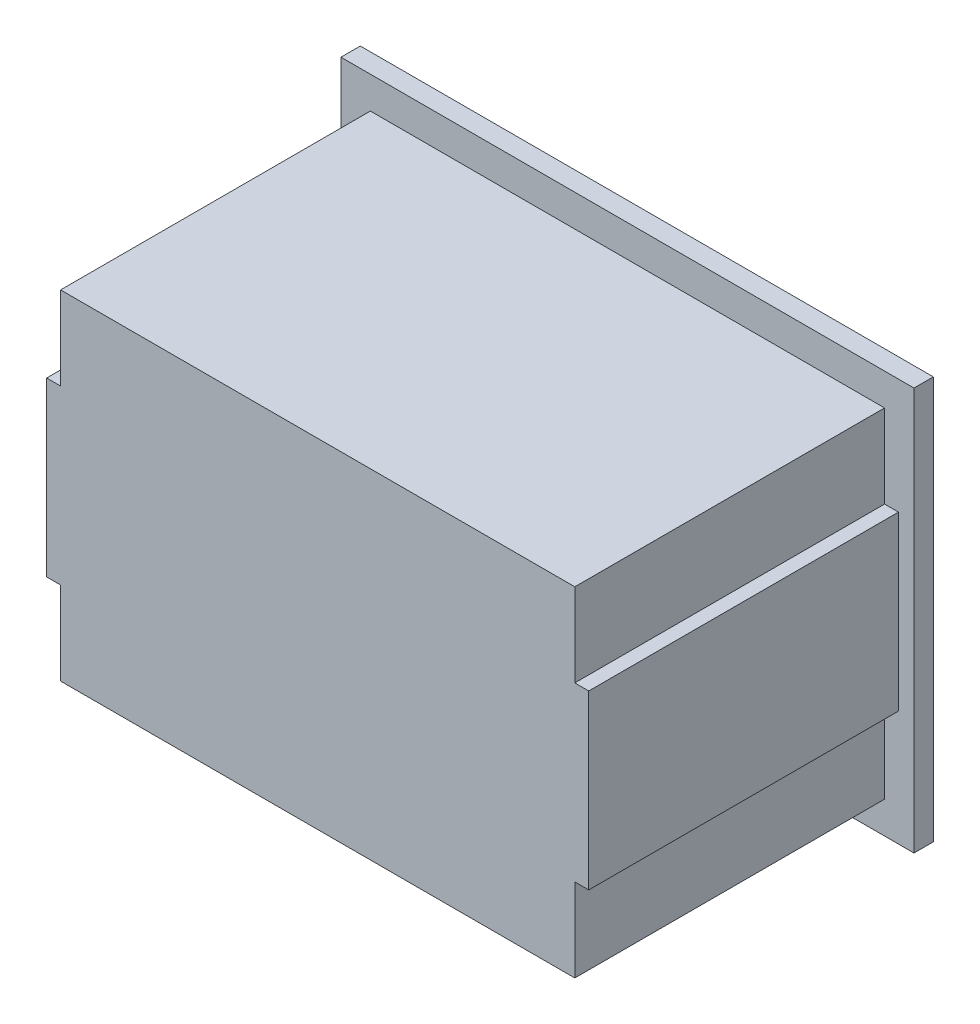
ISO-10303-21;
HEADER;
FILE_DESCRIPTION(('STEP AP214'),'2;1');
FILE_NAME('part.step','',(''),(''),'','','');
FILE_SCHEMA(('AUTOMOTIVE_DESIGN { 1 0 10303 214 1 1 1 1 }'));
ENDSEC;
DATA;
#1=APPLICATION_CONTEXT('core data for automotive mechanical design processes');
#2=APPLICATION_PROTOCOL_DEFINITION('international standard','automotive_design',2000,#1);
#3=PRODUCT_CONTEXT('',#1,'mechanical');
#4=PRODUCT('Part','Part','',(#3));
#5=PRODUCT_RELATED_PRODUCT_CATEGORY('part','',(#4));
#6=PRODUCT_DEFINITION_FORMATION('','',#4);
#7=PRODUCT_DEFINITION_CONTEXT('part definition',#1,'design');
#8=PRODUCT_DEFINITION('design','',#6,#7);
#9=PRODUCT_DEFINITION_SHAPE('','',#8);
#10=(LENGTH_UNIT() NAMED_UNIT(*) SI_UNIT(.MILLI.,.METRE.));
#11=(NAMED_UNIT(*) PLANE_ANGLE_UNIT() SI_UNIT($,.RADIAN.));
#12=(NAMED_UNIT(*) SI_UNIT($,.STERADIAN.) SOLID_ANGLE_UNIT());
#13=UNCERTAINTY_MEASURE_WITH_UNIT(LENGTH_MEASURE(1.E-05),#10,'distance_accuracy_value','');
#14=(GEOMETRIC_REPRESENTATION_CONTEXT(3) GLOBAL_UNCERTAINTY_ASSIGNED_CONTEXT((#13)) GLOBAL_UNIT_ASSIGNED_CONTEXT((#10,
#11,#12)) REPRESENTATION_CONTEXT('',''));
#15=CARTESIAN_POINT('',(0.,0.,0.));
#16=DIRECTION('',(0.,0.,1.));
#17=DIRECTION('',(1.,0.,0.));
#18=AXIS2_PLACEMENT_3D('',#15,#16,#17);
#19=CARTESIAN_POINT('',(6.64,4.375,8.));
#20=DIRECTION('',(-1.,0.,0.));
#21=DIRECTION('',(0.,-1.,0.));
#22=AXIS2_PLACEMENT_3D('',#19,#20,#21);
#23=PLANE('',#22);
#24=DIRECTION('',(0.,1.,0.));
#25=VECTOR('',#24,1.);
#26=CARTESIAN_POINT('',(6.64,4.375,0.));
#27=LINE('',#26,#25);
#28=CARTESIAN_POINT('',(6.64,-4.375,0.));
#29=VERTEX_POINT('',#28);
#30=CARTESIAN_POINT('',(6.64,-2.225,0.));
#31=VERTEX_POINT('',#30);
#32=EDGE_CURVE('E231',#29,#31,#27,.T.);
#33=ORIENTED_EDGE('',*,*,#32,.T.);
#34=DIRECTION('',(0.,0.,1.));
#35=VECTOR('',#34,1.);
#36=CARTESIAN_POINT('',(6.64,-2.225,8.));
#37=LINE('',#36,#35);
#38=CARTESIAN_POINT('',(6.64,-2.225,8.));
#39=VERTEX_POINT('',#38);
#40=EDGE_CURVE('E162',#31,#39,#37,.T.);
#41=ORIENTED_EDGE('',*,*,#40,.T.);
#42=DIRECTION('',(0.,1.,0.));
#43=VECTOR('',#42,1.);
#44=CARTESIAN_POINT('',(6.64,4.375,8.));
#45=LINE('',#44,#43);
#46=CARTESIAN_POINT('',(6.64,-4.375,8.));
#47=VERTEX_POINT('',#46);
#48=EDGE_CURVE('E218',#47,#39,#45,.T.);
#49=ORIENTED_EDGE('',*,*,#48,.F.);
#50=DIRECTION('',(0.,0.,-1.));
#51=VECTOR('',#50,1.);
#52=CARTESIAN_POINT('',(6.64,-4.375,8.));
#53=LINE('',#52,#51);
#54=EDGE_CURVE('E230',#47,#29,#53,.T.);
#55=ORIENTED_EDGE('',*,*,#54,.T.);
#56=EDGE_LOOP('',(#33,#41,#49,#55));
#57=FACE_BOUND('',#56,.T.);
#58=ADVANCED_FACE('F32',(#57),#23,.F.);
#59=CARTESIAN_POINT('',(-6.64,4.375,8.));
#60=DIRECTION('',(1.,0.,0.));
#61=DIRECTION('',(0.,1.,0.));
#62=AXIS2_PLACEMENT_3D('',#59,#60,#61);
#63=PLANE('',#62);
#64=DIRECTION('',(0.,-1.,0.));
#65=VECTOR('',#64,1.);
#66=CARTESIAN_POINT('',(-6.64,4.375,8.));
#67=LINE('',#66,#65);
#68=CARTESIAN_POINT('',(-6.64,-2.225,8.));
#69=VERTEX_POINT('',#68);
#70=CARTESIAN_POINT('',(-6.64,-4.375,8.));
#71=VERTEX_POINT('',#70);
#72=EDGE_CURVE('E224',#69,#71,#67,.T.);
#73=ORIENTED_EDGE('',*,*,#72,.F.);
#74=DIRECTION('',(0.,0.,-1.));
#75=VECTOR('',#74,1.);
#76=CARTESIAN_POINT('',(-6.64,-2.225,8.));
#77=LINE('',#76,#75);
#78=CARTESIAN_POINT('',(-6.64,-2.225,0.));
#79=VERTEX_POINT('',#78);
#80=EDGE_CURVE('E191',#69,#79,#77,.T.);
#81=ORIENTED_EDGE('',*,*,#80,.T.);
#82=DIRECTION('',(0.,-1.,0.));
#83=VECTOR('',#82,1.);
#84=CARTESIAN_POINT('',(-6.64,4.375,0.));
#85=LINE('',#84,#83);
#86=CARTESIAN_POINT('',(-6.64,-4.375,0.));
#87=VERTEX_POINT('',#86);
#88=EDGE_CURVE('E236',#79,#87,#85,.T.);
#89=ORIENTED_EDGE('',*,*,#88,.T.);
#90=DIRECTION('',(0.,0.,-1.));
#91=VECTOR('',#90,1.);
#92=CARTESIAN_POINT('',(-6.64,-4.375,8.));
#93=LINE('',#92,#91);
#94=EDGE_CURVE('E245',#71,#87,#93,.T.);
#95=ORIENTED_EDGE('',*,*,#94,.F.);
#96=EDGE_LOOP('',(#73,#81,#89,#95));
#97=FACE_BOUND('',#96,.T.);
#98=ADVANCED_FACE('F323',(#97),#63,.F.);
#99=CARTESIAN_POINT('',(6.64,2.225,8.));
#100=VERTEX_POINT('',#99);
#101=CARTESIAN_POINT('',(6.64,4.375,8.));
#102=VERTEX_POINT('',#101);
#103=EDGE_CURVE('E222',#100,#102,#45,.T.);
#104=ORIENTED_EDGE('',*,*,#103,.F.);
#105=DIRECTION('',(0.,0.,-1.));
#106=VECTOR('',#105,1.);
#107=CARTESIAN_POINT('',(6.64,2.225,8.));
#108=LINE('',#107,#106);
#109=CARTESIAN_POINT('',(6.64,2.225,0.));
#110=VERTEX_POINT('',#109);
#111=EDGE_CURVE('E188',#100,#110,#108,.T.);
#112=ORIENTED_EDGE('',*,*,#111,.T.);
#113=CARTESIAN_POINT('',(6.64,4.375,0.));
#114=VERTEX_POINT('',#113);
#115=EDGE_CURVE('E217',#110,#114,#27,.T.);
#116=ORIENTED_EDGE('',*,*,#115,.T.);
#117=DIRECTION('',(0.,0.,-1.));
#118=VECTOR('',#117,1.);
#119=CARTESIAN_POINT('',(6.64,4.375,8.));
#120=LINE('',#119,#118);
#121=EDGE_CURVE('E251',#102,#114,#120,.T.);
#122=ORIENTED_EDGE('',*,*,#121,.F.);
#123=EDGE_LOOP('',(#104,#112,#116,#122));
#124=FACE_BOUND('',#123,.T.);
#125=ADVANCED_FACE('F294',(#124),#23,.F.);
#126=CARTESIAN_POINT('',(-6.64,4.375,8.));
#127=DIRECTION('',(0.,-1.,0.));
#128=DIRECTION('',(0.,0.,-1.));
#129=AXIS2_PLACEMENT_3D('',#126,#127,#128);
#130=PLANE('',#129);
#131=DIRECTION('',(-1.,0.,0.));
#132=VECTOR('',#131,1.);
#133=CARTESIAN_POINT('',(-6.64,4.375,0.));
#134=LINE('',#133,#132);
#135=CARTESIAN_POINT('',(-6.64,4.375,0.));
#136=VERTEX_POINT('',#135);
#137=EDGE_CURVE('E233',#114,#136,#134,.T.);
#138=ORIENTED_EDGE('',*,*,#137,.T.);
#139=DIRECTION('',(0.,0.,-1.));
#140=VECTOR('',#139,1.);
#141=CARTESIAN_POINT('',(-6.64,4.375,8.));
#142=LINE('',#141,#140);
#143=CARTESIAN_POINT('',(-6.64,4.375,8.));
#144=VERTEX_POINT('',#143);
#145=EDGE_CURVE('E248',#144,#136,#142,.T.);
#146=ORIENTED_EDGE('',*,*,#145,.F.);
#147=DIRECTION('',(-1.,0.,0.));
#148=VECTOR('',#147,1.);
#149=CARTESIAN_POINT('',(-6.64,4.375,8.));
#150=LINE('',#149,#148);
#151=EDGE_CURVE('E221',#102,#144,#150,.T.);
#152=ORIENTED_EDGE('',*,*,#151,.F.);
#153=ORIENTED_EDGE('',*,*,#121,.T.);
#154=EDGE_LOOP('',(#138,#146,#152,#153));
#155=FACE_BOUND('',#154,.T.);
#156=ADVANCED_FACE('F290',(#155),#130,.F.);
#157=CARTESIAN_POINT('',(-6.64,2.225,0.));
#158=VERTEX_POINT('',#157);
#159=EDGE_CURVE('E237',#136,#158,#85,.T.);
#160=ORIENTED_EDGE('',*,*,#159,.T.);
#161=DIRECTION('',(0.,0.,1.));
#162=VECTOR('',#161,1.);
#163=CARTESIAN_POINT('',(-6.64,2.225,8.));
#164=LINE('',#163,#162);
#165=CARTESIAN_POINT('',(-6.64,2.225,8.));
#166=VERTEX_POINT('',#165);
#167=EDGE_CURVE('E185',#158,#166,#164,.T.);
#168=ORIENTED_EDGE('',*,*,#167,.T.);
#169=EDGE_CURVE('E225',#144,#166,#67,.T.);
#170=ORIENTED_EDGE('',*,*,#169,.F.);
#171=ORIENTED_EDGE('',*,*,#145,.T.);
#172=EDGE_LOOP('',(#160,#168,#170,#171));
#173=FACE_BOUND('',#172,.T.);
#174=ADVANCED_FACE('F285',(#173),#63,.F.);
#175=CARTESIAN_POINT('',(-6.64,-4.375,8.));
#176=DIRECTION('',(0.,1.,0.));
#177=DIRECTION('',(0.,0.,1.));
#178=AXIS2_PLACEMENT_3D('',#175,#176,#177);
#179=PLANE('',#178);
#180=DIRECTION('',(1.,0.,0.));
#181=VECTOR('',#180,1.);
#182=CARTESIAN_POINT('',(-6.64,-4.375,0.));
#183=LINE('',#182,#181);
#184=EDGE_CURVE('E240',#87,#29,#183,.T.);
#185=ORIENTED_EDGE('',*,*,#184,.T.);
#186=ORIENTED_EDGE('',*,*,#54,.F.);
#187=DIRECTION('',(1.,0.,0.));
#188=VECTOR('',#187,1.);
#189=CARTESIAN_POINT('',(-6.64,-4.375,8.));
#190=LINE('',#189,#188);
#191=EDGE_CURVE('E228',#71,#47,#190,.T.);
#192=ORIENTED_EDGE('',*,*,#191,.F.);
#193=ORIENTED_EDGE('',*,*,#94,.T.);
#194=EDGE_LOOP('',(#185,#186,#192,#193));
#195=FACE_BOUND('',#194,.T.);
#196=ADVANCED_FACE('F353',(#195),#179,.F.);
#197=CARTESIAN_POINT('',(0.,0.,8.));
#198=DIRECTION('',(0.,0.,1.));
#199=DIRECTION('',(1.,0.,0.));
#200=AXIS2_PLACEMENT_3D('',#197,#198,#199);
#201=PLANE('',#200);
#202=ORIENTED_EDGE('',*,*,#169,.T.);
#203=DIRECTION('',(-1.,0.,0.));
#204=VECTOR('',#203,1.);
#205=CARTESIAN_POINT('',(7.,2.225,8.));
#206=LINE('',#205,#204);
#207=CARTESIAN_POINT('',(-7.,2.225,8.));
#208=VERTEX_POINT('',#207);
#209=EDGE_CURVE('E302',#166,#208,#206,.T.);
#210=ORIENTED_EDGE('',*,*,#209,.T.);
#211=DIRECTION('',(0.,-1.,0.));
#212=VECTOR('',#211,1.);
#213=CARTESIAN_POINT('',(-7.,-2.225,8.));
#214=LINE('',#213,#212);
#215=CARTESIAN_POINT('',(-7.,-2.225,8.));
#216=VERTEX_POINT('',#215);
#217=EDGE_CURVE('E311',#208,#216,#214,.T.);
#218=ORIENTED_EDGE('',*,*,#217,.T.);
#219=DIRECTION('',(1.,0.,0.));
#220=VECTOR('',#219,1.);
#221=CARTESIAN_POINT('',(7.,-2.225,8.));
#222=LINE('',#221,#220);
#223=EDGE_CURVE('E307',#216,#69,#222,.T.);
#224=ORIENTED_EDGE('',*,*,#223,.T.);
#225=ORIENTED_EDGE('',*,*,#72,.T.);
#226=ORIENTED_EDGE('',*,*,#191,.T.);
#227=ORIENTED_EDGE('',*,*,#48,.T.);
#228=CARTESIAN_POINT('',(7.,-2.225,8.));
#229=VERTEX_POINT('',#228);
#230=EDGE_CURVE('E310',#39,#229,#222,.T.);
#231=ORIENTED_EDGE('',*,*,#230,.T.);
#232=DIRECTION('',(0.,1.,0.));
#233=VECTOR('',#232,1.);
#234=CARTESIAN_POINT('',(7.,-2.225,8.));
#235=LINE('',#234,#233);
#236=CARTESIAN_POINT('',(7.,2.225,8.));
#237=VERTEX_POINT('',#236);
#238=EDGE_CURVE('E167',#229,#237,#235,.T.);
#239=ORIENTED_EDGE('',*,*,#238,.T.);
#240=EDGE_CURVE('E299',#237,#100,#206,.T.);
#241=ORIENTED_EDGE('',*,*,#240,.T.);
#242=ORIENTED_EDGE('',*,*,#103,.T.);
#243=ORIENTED_EDGE('',*,*,#151,.T.);
#244=EDGE_LOOP('',(#202,#210,#218,#224,#225,#226,#227,#231,#239,#241,#242,#243));
#245=FACE_BOUND('',#244,.T.);
#246=ADVANCED_FACE('F301',(#245),#201,.T.);
#247=CARTESIAN_POINT('',(7.4,-5.2,-1.));
#248=DIRECTION('',(-1.,0.,0.));
#249=DIRECTION('',(0.,0.,1.));
#250=AXIS2_PLACEMENT_3D('',#247,#248,#249);
#251=PLANE('',#250);
#252=DIRECTION('',(0.,0.,1.));
#253=VECTOR('',#252,1.);
#254=CARTESIAN_POINT('',(7.4,-5.2,-1.));
#255=LINE('',#254,#253);
#256=CARTESIAN_POINT('',(7.4,-5.2,-0.499999999999998));
#257=VERTEX_POINT('',#256);
#258=CARTESIAN_POINT('',(7.4,-5.2,0.));
#259=VERTEX_POINT('',#258);
#260=EDGE_CURVE('E215',#257,#259,#255,.T.);
#261=ORIENTED_EDGE('',*,*,#260,.F.);
#262=DIRECTION('',(0.,1.,0.));
#263=VECTOR('',#262,1.);
#264=CARTESIAN_POINT('',(7.4,5.2,-0.499999999999998));
#265=LINE('',#264,#263);
#266=CARTESIAN_POINT('',(7.4,5.2,-0.499999999999998));
#267=VERTEX_POINT('',#266);
#268=EDGE_CURVE('E268',#257,#267,#265,.T.);
#269=ORIENTED_EDGE('',*,*,#268,.T.);
#270=DIRECTION('',(0.,0.,1.));
#271=VECTOR('',#270,1.);
#272=CARTESIAN_POINT('',(7.4,5.2,-1.));
#273=LINE('',#272,#271);
#274=CARTESIAN_POINT('',(7.4,5.2,0.));
#275=VERTEX_POINT('',#274);
#276=EDGE_CURVE('E209',#267,#275,#273,.T.);
#277=ORIENTED_EDGE('',*,*,#276,.T.);
#278=DIRECTION('',(0.,-1.,0.));
#279=VECTOR('',#278,1.);
#280=CARTESIAN_POINT('',(7.4,-5.2,0.));
#281=LINE('',#280,#279);
#282=EDGE_CURVE('E196',#275,#259,#281,.T.);
#283=ORIENTED_EDGE('',*,*,#282,.T.);
#284=EDGE_LOOP('',(#261,#269,#277,#283));
#285=FACE_BOUND('',#284,.T.);
#286=ADVANCED_FACE('F360',(#285),#251,.F.);
#287=CARTESIAN_POINT('',(-7.4,-5.2,-1.));
#288=DIRECTION('',(0.,1.,0.));
#289=DIRECTION('',(-1.,0.,0.));
#290=AXIS2_PLACEMENT_3D('',#287,#288,#289);
#291=PLANE('',#290);
#292=DIRECTION('',(0.,0.,1.));
#293=VECTOR('',#292,1.);
#294=CARTESIAN_POINT('',(-7.4,-5.2,-1.));
#295=LINE('',#294,#293);
#296=CARTESIAN_POINT('',(-7.4,-5.2,-0.499999999999998));
#297=VERTEX_POINT('',#296);
#298=CARTESIAN_POINT('',(-7.4,-5.2,0.));
#299=VERTEX_POINT('',#298);
#300=EDGE_CURVE('E213',#297,#299,#295,.T.);
#301=ORIENTED_EDGE('',*,*,#300,.F.);
#302=DIRECTION('',(1.,0.,0.));
#303=VECTOR('',#302,1.);
#304=CARTESIAN_POINT('',(7.4,-5.2,-0.499999999999998));
#305=LINE('',#304,#303);
#306=EDGE_CURVE('E266',#297,#257,#305,.T.);
#307=ORIENTED_EDGE('',*,*,#306,.T.);
#308=ORIENTED_EDGE('',*,*,#260,.T.);
#309=DIRECTION('',(-1.,0.,0.));
#310=VECTOR('',#309,1.);
#311=CARTESIAN_POINT('',(-7.4,-5.2,0.));
#312=LINE('',#311,#310);
#313=EDGE_CURVE('E199',#259,#299,#312,.T.);
#314=ORIENTED_EDGE('',*,*,#313,.T.);
#315=EDGE_LOOP('',(#301,#307,#308,#314));
#316=FACE_BOUND('',#315,.T.);
#317=ADVANCED_FACE('F363',(#316),#291,.F.);
#318=CARTESIAN_POINT('',(-7.4,-5.2,-1.));
#319=DIRECTION('',(1.,0.,0.));
#320=DIRECTION('',(0.,0.,-1.));
#321=AXIS2_PLACEMENT_3D('',#318,#319,#320);
#322=PLANE('',#321);
#323=DIRECTION('',(0.,0.,1.));
#324=VECTOR('',#323,1.);
#325=CARTESIAN_POINT('',(-7.4,5.2,-1.));
#326=LINE('',#325,#324);
#327=CARTESIAN_POINT('',(-7.4,5.2,-0.499999999999998));
#328=VERTEX_POINT('',#327);
#329=CARTESIAN_POINT('',(-7.4,5.2,0.));
#330=VERTEX_POINT('',#329);
#331=EDGE_CURVE('E211',#328,#330,#326,.T.);
#332=ORIENTED_EDGE('',*,*,#331,.F.);
#333=DIRECTION('',(0.,-1.,0.));
#334=VECTOR('',#333,1.);
#335=CARTESIAN_POINT('',(-7.4,-5.2,-0.499999999999998));
#336=LINE('',#335,#334);
#337=EDGE_CURVE('E263',#328,#297,#336,.T.);
#338=ORIENTED_EDGE('',*,*,#337,.T.);
#339=ORIENTED_EDGE('',*,*,#300,.T.);
#340=DIRECTION('',(0.,1.,0.));
#341=VECTOR('',#340,1.);
#342=CARTESIAN_POINT('',(-7.4,-5.2,0.));
#343=LINE('',#342,#341);
#344=EDGE_CURVE('E203',#299,#330,#343,.T.);
#345=ORIENTED_EDGE('',*,*,#344,.T.);
#346=EDGE_LOOP('',(#332,#338,#339,#345));
#347=FACE_BOUND('',#346,.T.);
#348=ADVANCED_FACE('F367',(#347),#322,.F.);
#349=CARTESIAN_POINT('',(-7.4,5.2,-1.));
#350=DIRECTION('',(0.,-1.,0.));
#351=DIRECTION('',(1.,0.,0.));
#352=AXIS2_PLACEMENT_3D('',#349,#350,#351);
#353=PLANE('',#352);
#354=ORIENTED_EDGE('',*,*,#276,.F.);
#355=DIRECTION('',(-1.,0.,0.));
#356=VECTOR('',#355,1.);
#357=CARTESIAN_POINT('',(-7.4,5.2,-0.499999999999998));
#358=LINE('',#357,#356);
#359=EDGE_CURVE('E270',#267,#328,#358,.T.);
#360=ORIENTED_EDGE('',*,*,#359,.T.);
#361=ORIENTED_EDGE('',*,*,#331,.T.);
#362=DIRECTION('',(1.,0.,0.));
#363=VECTOR('',#362,1.);
#364=CARTESIAN_POINT('',(-7.4,5.2,0.));
#365=LINE('',#364,#363);
#366=EDGE_CURVE('E206',#330,#275,#365,.T.);
#367=ORIENTED_EDGE('',*,*,#366,.T.);
#368=EDGE_LOOP('',(#354,#360,#361,#367));
#369=FACE_BOUND('',#368,.T.);
#370=ADVANCED_FACE('F371',(#369),#353,.F.);
#371=CARTESIAN_POINT('',(0.,0.,-1.));
#372=DIRECTION('',(0.,0.,-1.));
#373=DIRECTION('',(-1.,0.,0.));
#374=AXIS2_PLACEMENT_3D('',#371,#372,#373);
#375=PLANE('',#374);
#376=DIRECTION('',(-1.,0.,0.));
#377=VECTOR('',#376,1.);
#378=CARTESIAN_POINT('',(-7.4,-4.7,-1.));
#379=LINE('',#378,#377);
#380=CARTESIAN_POINT('',(6.9,-4.7,-1.));
#381=VERTEX_POINT('',#380);
#382=CARTESIAN_POINT('',(-6.9,-4.7,-1.));
#383=VERTEX_POINT('',#382);
#384=EDGE_CURVE('E258',#381,#383,#379,.T.);
#385=ORIENTED_EDGE('',*,*,#384,.T.);
#386=DIRECTION('',(0.,1.,0.));
#387=VECTOR('',#386,1.);
#388=CARTESIAN_POINT('',(-6.9,5.2,-1.));
#389=LINE('',#388,#387);
#390=CARTESIAN_POINT('',(-6.9,4.7,-1.));
#391=VERTEX_POINT('',#390);
#392=EDGE_CURVE('E260',#383,#391,#389,.T.);
#393=ORIENTED_EDGE('',*,*,#392,.T.);
#394=DIRECTION('',(1.,0.,0.));
#395=VECTOR('',#394,1.);
#396=CARTESIAN_POINT('',(7.4,4.7,-1.));
#397=LINE('',#396,#395);
#398=CARTESIAN_POINT('',(6.9,4.7,-1.));
#399=VERTEX_POINT('',#398);
#400=EDGE_CURVE('E254',#391,#399,#397,.T.);
#401=ORIENTED_EDGE('',*,*,#400,.T.);
#402=DIRECTION('',(0.,-1.,0.));
#403=VECTOR('',#402,1.);
#404=CARTESIAN_POINT('',(6.9,-5.2,-1.));
#405=LINE('',#404,#403);
#406=EDGE_CURVE('E256',#399,#381,#405,.T.);
#407=ORIENTED_EDGE('',*,*,#406,.T.);
#408=EDGE_LOOP('',(#385,#393,#401,#407));
#409=FACE_BOUND('',#408,.T.);
#410=ADVANCED_FACE('F375',(#409),#375,.T.);
#411=CARTESIAN_POINT('',(0.,0.,0.));
#412=DIRECTION('',(0.,0.,-1.));
#413=DIRECTION('',(-1.,0.,0.));
#414=AXIS2_PLACEMENT_3D('',#411,#412,#413);
#415=PLANE('',#414);
#416=DIRECTION('',(0.,1.,0.));
#417=VECTOR('',#416,1.);
#418=CARTESIAN_POINT('',(7.,-2.225,0.));
#419=LINE('',#418,#417);
#420=CARTESIAN_POINT('',(7.,-2.225,0.));
#421=VERTEX_POINT('',#420);
#422=CARTESIAN_POINT('',(7.,2.225,0.));
#423=VERTEX_POINT('',#422);
#424=EDGE_CURVE('E47',#421,#423,#419,.T.);
#425=ORIENTED_EDGE('',*,*,#424,.F.);
#426=DIRECTION('',(-1.,0.,0.));
#427=VECTOR('',#426,1.);
#428=CARTESIAN_POINT('',(0.,-2.225,0.));
#429=LINE('',#428,#427);
#430=EDGE_CURVE('E11',#421,#31,#429,.T.);
#431=ORIENTED_EDGE('',*,*,#430,.T.);
#432=ORIENTED_EDGE('',*,*,#32,.F.);
#433=ORIENTED_EDGE('',*,*,#184,.F.);
#434=ORIENTED_EDGE('',*,*,#88,.F.);
#435=DIRECTION('',(1.,0.,0.));
#436=VECTOR('',#435,1.);
#437=CARTESIAN_POINT('',(7.,-2.225,0.));
#438=LINE('',#437,#436);
#439=CARTESIAN_POINT('',(-7.,-2.225,0.));
#440=VERTEX_POINT('',#439);
#441=EDGE_CURVE('E168',#440,#79,#438,.T.);
#442=ORIENTED_EDGE('',*,*,#441,.F.);
#443=DIRECTION('',(0.,-1.,0.));
#444=VECTOR('',#443,1.);
#445=CARTESIAN_POINT('',(-7.,-2.225,0.));
#446=LINE('',#445,#444);
#447=CARTESIAN_POINT('',(-7.,2.225,0.));
#448=VERTEX_POINT('',#447);
#449=EDGE_CURVE('E181',#448,#440,#446,.T.);
#450=ORIENTED_EDGE('',*,*,#449,.F.);
#451=DIRECTION('',(1.,0.,0.));
#452=VECTOR('',#451,1.);
#453=CARTESIAN_POINT('',(0.,2.225,0.));
#454=LINE('',#453,#452);
#455=EDGE_CURVE('E40',#448,#158,#454,.T.);
#456=ORIENTED_EDGE('',*,*,#455,.T.);
#457=ORIENTED_EDGE('',*,*,#159,.F.);
#458=ORIENTED_EDGE('',*,*,#137,.F.);
#459=ORIENTED_EDGE('',*,*,#115,.F.);
#460=DIRECTION('',(-1.,0.,0.));
#461=VECTOR('',#460,1.);
#462=CARTESIAN_POINT('',(7.,2.225,0.));
#463=LINE('',#462,#461);
#464=EDGE_CURVE('E174',#423,#110,#463,.T.);
#465=ORIENTED_EDGE('',*,*,#464,.F.);
#466=EDGE_LOOP('',(#425,#431,#432,#433,#434,#442,#450,#456,#457,#458,#459,#465));
#467=FACE_BOUND('',#466,.T.);
#468=ORIENTED_EDGE('',*,*,#282,.F.);
#469=ORIENTED_EDGE('',*,*,#366,.F.);
#470=ORIENTED_EDGE('',*,*,#344,.F.);
#471=ORIENTED_EDGE('',*,*,#313,.F.);
#472=EDGE_LOOP('',(#468,#469,#470,#471));
#473=FACE_BOUND('',#472,.T.);
#474=ADVANCED_FACE('F171',(#467,#473),#415,.F.);
#475=CARTESIAN_POINT('',(6.9,0.,-1.));
#476=DIRECTION('',(0.707106781186549,0.,-0.707106781186546));
#477=DIRECTION('',(0.,1.,0.));
#478=AXIS2_PLACEMENT_3D('',#475,#476,#477);
#479=PLANE('',#478);
#480=DIRECTION('',(-0.577350269189625,-0.577350269189625,-0.577350269189627));
#481=VECTOR('',#480,1.);
#482=CARTESIAN_POINT('',(4.6,2.4,-3.3));
#483=LINE('',#482,#481);
#484=EDGE_CURVE('E275',#267,#399,#483,.T.);
#485=ORIENTED_EDGE('',*,*,#484,.F.);
#486=ORIENTED_EDGE('',*,*,#268,.F.);
#487=DIRECTION('',(-0.577350269189625,0.577350269189625,-0.577350269189627));
#488=VECTOR('',#487,1.);
#489=CARTESIAN_POINT('',(5.33333333333333,-3.13333333333334,-2.56666666666667));
#490=LINE('',#489,#488);
#491=EDGE_CURVE('E200',#381,#257,#490,.F.);
#492=ORIENTED_EDGE('',*,*,#491,.F.);
#493=ORIENTED_EDGE('',*,*,#406,.F.);
#494=EDGE_LOOP('',(#485,#486,#492,#493));
#495=FACE_BOUND('',#494,.T.);
#496=ADVANCED_FACE('F34',(#495),#479,.T.);
#497=CARTESIAN_POINT('',(0.,-4.7,-1.));
#498=DIRECTION('',(0.,-0.707106781186549,-0.707106781186546));
#499=DIRECTION('',(1.,0.,0.));
#500=AXIS2_PLACEMENT_3D('',#497,#498,#499);
#501=PLANE('',#500);
#502=ORIENTED_EDGE('',*,*,#491,.T.);
#503=ORIENTED_EDGE('',*,*,#306,.F.);
#504=DIRECTION('',(0.577350269189625,0.577350269189625,-0.577350269189627));
#505=VECTOR('',#504,1.);
#506=CARTESIAN_POINT('',(-4.60000000000001,-2.4,-3.3));
#507=LINE('',#506,#505);
#508=EDGE_CURVE('E273',#383,#297,#507,.F.);
#509=ORIENTED_EDGE('',*,*,#508,.F.);
#510=ORIENTED_EDGE('',*,*,#384,.F.);
#511=EDGE_LOOP('',(#502,#503,#509,#510));
#512=FACE_BOUND('',#511,.T.);
#513=ADVANCED_FACE('F463',(#512),#501,.T.);
#514=CARTESIAN_POINT('',(0.,4.7,-1.));
#515=DIRECTION('',(0.,0.707106781186549,-0.707106781186546));
#516=DIRECTION('',(-1.,0.,0.));
#517=AXIS2_PLACEMENT_3D('',#514,#515,#516);
#518=PLANE('',#517);
#519=ORIENTED_EDGE('',*,*,#484,.T.);
#520=ORIENTED_EDGE('',*,*,#400,.F.);
#521=DIRECTION('',(-0.577350269189625,0.577350269189625,0.577350269189627));
#522=VECTOR('',#521,1.);
#523=CARTESIAN_POINT('',(-4.6,2.4,-3.3));
#524=LINE('',#523,#522);
#525=EDGE_CURVE('E195',#328,#391,#524,.F.);
#526=ORIENTED_EDGE('',*,*,#525,.F.);
#527=ORIENTED_EDGE('',*,*,#359,.F.);
#528=EDGE_LOOP('',(#519,#520,#526,#527));
#529=FACE_BOUND('',#528,.T.);
#530=ADVANCED_FACE('F454',(#529),#518,.T.);
#531=CARTESIAN_POINT('',(-6.9,0.,-1.));
#532=DIRECTION('',(-0.707106781186549,0.,-0.707106781186546));
#533=DIRECTION('',(0.,-1.,0.));
#534=AXIS2_PLACEMENT_3D('',#531,#532,#533);
#535=PLANE('',#534);
#536=ORIENTED_EDGE('',*,*,#508,.T.);
#537=ORIENTED_EDGE('',*,*,#337,.F.);
#538=ORIENTED_EDGE('',*,*,#525,.T.);
#539=ORIENTED_EDGE('',*,*,#392,.F.);
#540=EDGE_LOOP('',(#536,#537,#538,#539));
#541=FACE_BOUND('',#540,.T.);
#542=ADVANCED_FACE('F333',(#541),#535,.T.);
#543=CARTESIAN_POINT('',(-7.,-2.225,-14.690217833647));
#544=DIRECTION('',(-1.,0.,0.));
#545=DIRECTION('',(0.,0.,1.));
#546=AXIS2_PLACEMENT_3D('',#543,#544,#545);
#547=PLANE('',#546);
#548=DIRECTION('',(0.,0.,1.));
#549=VECTOR('',#548,1.);
#550=CARTESIAN_POINT('',(-7.,2.225,-14.690217833647));
#551=LINE('',#550,#549);
#552=EDGE_CURVE('E55',#448,#208,#551,.T.);
#553=ORIENTED_EDGE('',*,*,#552,.F.);
#554=ORIENTED_EDGE('',*,*,#449,.T.);
#555=DIRECTION('',(0.,0.,1.));
#556=VECTOR('',#555,1.);
#557=CARTESIAN_POINT('',(-7.,-2.225,-14.690217833647));
#558=LINE('',#557,#556);
#559=EDGE_CURVE('E183',#440,#216,#558,.T.);
#560=ORIENTED_EDGE('',*,*,#559,.T.);
#561=ORIENTED_EDGE('',*,*,#217,.F.);
#562=EDGE_LOOP('',(#553,#554,#560,#561));
#563=FACE_BOUND('',#562,.T.);
#564=ADVANCED_FACE('F314',(#563),#547,.T.);
#565=CARTESIAN_POINT('',(7.,2.225,-14.690217833647));
#566=DIRECTION('',(0.,1.,0.));
#567=DIRECTION('',(-1.,0.,0.));
#568=AXIS2_PLACEMENT_3D('',#565,#566,#567);
#569=PLANE('',#568);
#570=ORIENTED_EDGE('',*,*,#167,.F.);
#571=ORIENTED_EDGE('',*,*,#455,.F.);
#572=ORIENTED_EDGE('',*,*,#552,.T.);
#573=ORIENTED_EDGE('',*,*,#209,.F.);
#574=EDGE_LOOP('',(#570,#571,#572,#573));
#575=FACE_BOUND('',#574,.T.);
#576=ADVANCED_FACE('F325',(#575),#569,.T.);
#577=CARTESIAN_POINT('',(7.,-2.225,-14.690217833647));
#578=DIRECTION('',(0.,-1.,0.));
#579=DIRECTION('',(1.,0.,0.));
#580=AXIS2_PLACEMENT_3D('',#577,#578,#579);
#581=PLANE('',#580);
#582=ORIENTED_EDGE('',*,*,#80,.F.);
#583=ORIENTED_EDGE('',*,*,#223,.F.);
#584=ORIENTED_EDGE('',*,*,#559,.F.);
#585=ORIENTED_EDGE('',*,*,#441,.T.);
#586=EDGE_LOOP('',(#582,#583,#584,#585));
#587=FACE_BOUND('',#586,.T.);
#588=ADVANCED_FACE('F317',(#587),#581,.T.);
#589=ORIENTED_EDGE('',*,*,#40,.F.);
#590=ORIENTED_EDGE('',*,*,#430,.F.);
#591=DIRECTION('',(0.,0.,1.));
#592=VECTOR('',#591,1.);
#593=CARTESIAN_POINT('',(7.,-2.225,-14.690217833647));
#594=LINE('',#593,#592);
#595=EDGE_CURVE('E159',#421,#229,#594,.T.);
#596=ORIENTED_EDGE('',*,*,#595,.T.);
#597=ORIENTED_EDGE('',*,*,#230,.F.);
#598=EDGE_LOOP('',(#589,#590,#596,#597));
#599=FACE_BOUND('',#598,.T.);
#600=ADVANCED_FACE('F158',(#599),#581,.T.);
#601=ORIENTED_EDGE('',*,*,#111,.F.);
#602=ORIENTED_EDGE('',*,*,#240,.F.);
#603=DIRECTION('',(0.,0.,1.));
#604=VECTOR('',#603,1.);
#605=CARTESIAN_POINT('',(7.,2.225,-14.690217833647));
#606=LINE('',#605,#604);
#607=EDGE_CURVE('E175',#423,#237,#606,.T.);
#608=ORIENTED_EDGE('',*,*,#607,.F.);
#609=ORIENTED_EDGE('',*,*,#464,.T.);
#610=EDGE_LOOP('',(#601,#602,#608,#609));
#611=FACE_BOUND('',#610,.T.);
#612=ADVANCED_FACE('F298',(#611),#569,.T.);
#613=CARTESIAN_POINT('',(7.,-2.225,-14.690217833647));
#614=DIRECTION('',(1.,0.,0.));
#615=DIRECTION('',(0.,0.,-1.));
#616=AXIS2_PLACEMENT_3D('',#613,#614,#615);
#617=PLANE('',#616);
#618=ORIENTED_EDGE('',*,*,#595,.F.);
#619=ORIENTED_EDGE('',*,*,#424,.T.);
#620=ORIENTED_EDGE('',*,*,#607,.T.);
#621=ORIENTED_EDGE('',*,*,#238,.F.);
#622=EDGE_LOOP('',(#618,#619,#620,#621));
#623=FACE_BOUND('',#622,.T.);
#624=ADVANCED_FACE('F165',(#623),#617,.T.);
#625=CLOSED_SHELL('',(#58,#98,#125,#156,#174,#196,#246,#286,#317,#348,#370,#410,#474,#496,#513,
#530,#542,#564,#576,#588,#600,#612,#624));
#626=MANIFOLD_SOLID_BREP('B2',#625);
#627=ADVANCED_BREP_SHAPE_REPRESENTATION('',(#18,#626),#14);
#628=SHAPE_DEFINITION_REPRESENTATION(#9,#627);
ENDSEC;
END-ISO-10303-21;
